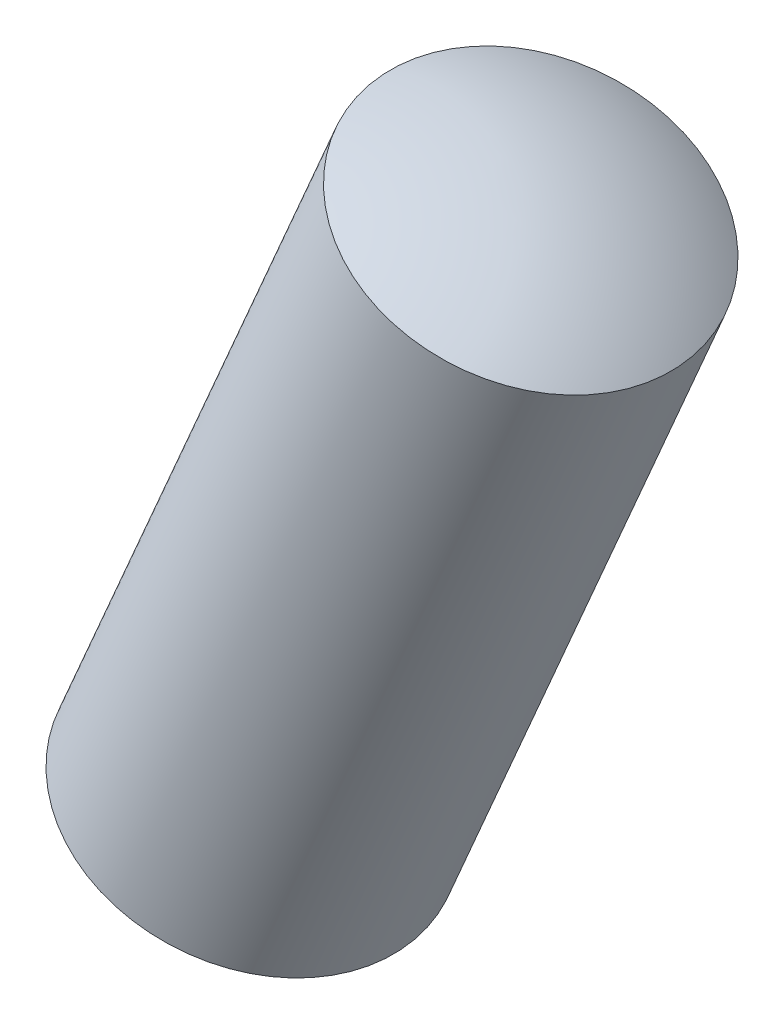
ISO-10303-21;
HEADER;
FILE_DESCRIPTION(('STEP AP214'),'2;1');
FILE_NAME('part.step','',(''),(''),'','','');
FILE_SCHEMA(('AUTOMOTIVE_DESIGN { 1 0 10303 214 1 1 1 1 }'));
ENDSEC;
DATA;
#1=APPLICATION_CONTEXT('core data for automotive mechanical design processes');
#2=APPLICATION_PROTOCOL_DEFINITION('international standard','automotive_design',2000,#1);
#3=PRODUCT_CONTEXT('',#1,'mechanical');
#4=PRODUCT('Part','Part','',(#3));
#5=PRODUCT_RELATED_PRODUCT_CATEGORY('part','',(#4));
#6=PRODUCT_DEFINITION_FORMATION('','',#4);
#7=PRODUCT_DEFINITION_CONTEXT('part definition',#1,'design');
#8=PRODUCT_DEFINITION('design','',#6,#7);
#9=PRODUCT_DEFINITION_SHAPE('','',#8);
#10=(LENGTH_UNIT() NAMED_UNIT(*) SI_UNIT(.MILLI.,.METRE.));
#11=(NAMED_UNIT(*) PLANE_ANGLE_UNIT() SI_UNIT($,.RADIAN.));
#12=(NAMED_UNIT(*) SI_UNIT($,.STERADIAN.) SOLID_ANGLE_UNIT());
#13=UNCERTAINTY_MEASURE_WITH_UNIT(LENGTH_MEASURE(1.E-05),#10,'distance_accuracy_value','');
#14=(GEOMETRIC_REPRESENTATION_CONTEXT(3) GLOBAL_UNCERTAINTY_ASSIGNED_CONTEXT((#13)) GLOBAL_UNIT_ASSIGNED_CONTEXT((#10,
#11,#12)) REPRESENTATION_CONTEXT('',''));
#15=CARTESIAN_POINT('',(0.,0.,0.));
#16=DIRECTION('',(0.,0.,1.));
#17=DIRECTION('',(1.,0.,0.));
#18=AXIS2_PLACEMENT_3D('',#15,#16,#17);
#19=CARTESIAN_POINT('',(8.83498523892468,20.4892834792239,0.599999999999989));
#20=DIRECTION('',(0.918268728285105,-0.395957753622349,0.));
#21=DIRECTION('',(0.39595775362235,0.918268728285104,0.));
#22=AXIS2_PLACEMENT_3D('',#19,#20,#21);
#23=SPHERICAL_SURFACE('',#22,2.);
#24=CARTESIAN_POINT('',(8.83498523892468,20.4892834792239,0.599999999999989));
#25=DIRECTION('',(-0.39595775362235,-0.918268728285104,0.));
#26=DIRECTION('',(0.,0.,-1.));
#27=AXIS2_PLACEMENT_3D('',#24,#25,#26);
#28=SPHERICAL_SURFACE('',#27,2.);
#29=CARTESIAN_POINT('',(9.52080418584941,22.0797715716154,0.6));
#30=DIRECTION('',(-0.39595775362235,-0.918268728285104,0.));
#31=DIRECTION('',(0.,0.,-1.));
#32=AXIS2_PLACEMENT_3D('',#29,#30,#31);
#33=CIRCLE('',#32,1.);
#34=CARTESIAN_POINT('',(9.52080418584941,22.0797715716154,-0.4));
#35=VERTEX_POINT('',#34);
#36=EDGE_CURVE('E11',#35,#35,#33,.T.);
#37=ORIENTED_EDGE('',*,*,#36,.F.);
#38=EDGE_LOOP('',(#37));
#39=FACE_BOUND('',#38,.T.);
#40=ADVANCED_FACE('F17',(#39),#28,.T.);
#41=CARTESIAN_POINT('',(8.38917704364759,19.4554062011782,0.599999999999989));
#42=DIRECTION('',(0.918268728285104,-0.395957753622351,0.));
#43=DIRECTION('',(-0.39595775362235,-0.918268728285104,0.));
#44=AXIS2_PLACEMENT_3D('',#41,#42,#43);
#45=SPHERICAL_SURFACE('',#44,2.);
#46=CARTESIAN_POINT('',(8.38917704364759,19.4554062011782,0.599999999999989));
#47=DIRECTION('',(-0.39595775362235,-0.918268728285104,0.));
#48=DIRECTION('',(0.,0.,-1.));
#49=AXIS2_PLACEMENT_3D('',#46,#47,#48);
#50=SPHERICAL_SURFACE('',#49,2.);
#51=CARTESIAN_POINT('',(7.70335809672279,17.8649181087866,0.6));
#52=DIRECTION('',(-0.39595775362235,-0.918268728285104,0.));
#53=DIRECTION('',(0.,0.,-1.));
#54=AXIS2_PLACEMENT_3D('',#51,#52,#53);
#55=CIRCLE('',#54,1.);
#56=CARTESIAN_POINT('',(7.70335809672279,17.8649181087866,-0.4));
#57=VERTEX_POINT('',#56);
#58=EDGE_CURVE('E21',#57,#57,#55,.T.);
#59=ORIENTED_EDGE('',*,*,#58,.T.);
#60=EDGE_LOOP('',(#59));
#61=FACE_BOUND('',#60,.T.);
#62=ADVANCED_FACE('F40',(#61),#50,.T.);
#63=CARTESIAN_POINT('',(8.15771961900443,18.9186314744938,0.6));
#64=DIRECTION('',(-0.39595775362235,-0.918268728285104,0.));
#65=DIRECTION('',(0.,0.,-1.));
#66=AXIS2_PLACEMENT_3D('',#63,#64,#65);
#67=CYLINDRICAL_SURFACE('',#66,1.);
#68=ORIENTED_EDGE('',*,*,#36,.T.);
#69=EDGE_LOOP('',(#68));
#70=FACE_BOUND('',#69,.T.);
#71=ORIENTED_EDGE('',*,*,#58,.F.);
#72=EDGE_LOOP('',(#71));
#73=FACE_BOUND('',#72,.T.);
#74=ADVANCED_FACE('F19',(#70,#73),#67,.T.);
#75=CLOSED_SHELL('',(#40,#62,#74));
#76=MANIFOLD_SOLID_BREP('B1',#75);
#77=ADVANCED_BREP_SHAPE_REPRESENTATION('',(#18,#76),#14);
#78=SHAPE_DEFINITION_REPRESENTATION(#9,#77);
ENDSEC;
END-ISO-10303-21;
